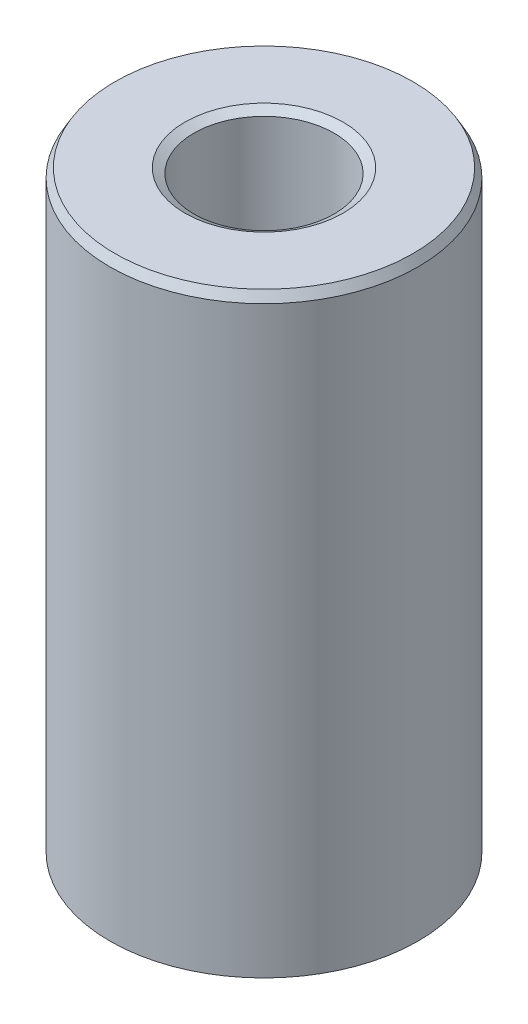
ISO-10303-21;
HEADER;
FILE_DESCRIPTION(('STEP AP214'),'2;1');
FILE_NAME('part.step','',(''),(''),'','','');
FILE_SCHEMA(('AUTOMOTIVE_DESIGN { 1 0 10303 214 1 1 1 1 }'));
ENDSEC;
DATA;
#1=APPLICATION_CONTEXT('core data for automotive mechanical design processes');
#2=APPLICATION_PROTOCOL_DEFINITION('international standard','automotive_design',2000,#1);
#3=PRODUCT_CONTEXT('',#1,'mechanical');
#4=PRODUCT('Part','Part','',(#3));
#5=PRODUCT_RELATED_PRODUCT_CATEGORY('part','',(#4));
#6=PRODUCT_DEFINITION_FORMATION('','',#4);
#7=PRODUCT_DEFINITION_CONTEXT('part definition',#1,'design');
#8=PRODUCT_DEFINITION('design','',#6,#7);
#9=PRODUCT_DEFINITION_SHAPE('','',#8);
#10=(LENGTH_UNIT() NAMED_UNIT(*) SI_UNIT(.MILLI.,.METRE.));
#11=(NAMED_UNIT(*) PLANE_ANGLE_UNIT() SI_UNIT($,.RADIAN.));
#12=(NAMED_UNIT(*) SI_UNIT($,.STERADIAN.) SOLID_ANGLE_UNIT());
#13=UNCERTAINTY_MEASURE_WITH_UNIT(LENGTH_MEASURE(1.E-05),#10,'distance_accuracy_value','');
#14=(GEOMETRIC_REPRESENTATION_CONTEXT(3) GLOBAL_UNCERTAINTY_ASSIGNED_CONTEXT((#13)) GLOBAL_UNIT_ASSIGNED_CONTEXT((#10,
#11,#12)) REPRESENTATION_CONTEXT('',''));
#15=CARTESIAN_POINT('',(0.,0.,0.));
#16=DIRECTION('',(0.,0.,1.));
#17=DIRECTION('',(1.,0.,0.));
#18=AXIS2_PLACEMENT_3D('',#15,#16,#17);
#19=CARTESIAN_POINT('',(0.,232.813612719743,0.));
#20=DIRECTION('',(0.,-1.,0.));
#21=DIRECTION('',(0.,0.,-1.));
#22=AXIS2_PLACEMENT_3D('',#19,#20,#21);
#23=CYLINDRICAL_SURFACE('',#22,60.);
#24=CARTESIAN_POINT('',(0.,2.00038068388453,0.));
#25=DIRECTION('',(0.,1.,0.));
#26=DIRECTION('',(0.,0.,1.));
#27=AXIS2_PLACEMENT_3D('',#24,#25,#26);
#28=CIRCLE('',#27,60.);
#29=CARTESIAN_POINT('',(0.,2.00038068388453,60.));
#30=VERTEX_POINT('',#29);
#31=EDGE_CURVE('E10',#30,#30,#28,.T.);
#32=ORIENTED_EDGE('',*,*,#31,.T.);
#33=EDGE_LOOP('',(#32));
#34=FACE_BOUND('',#33,.T.);
#35=CARTESIAN_POINT('',(0.,229.348851740776,0.));
#36=DIRECTION('',(0.,1.,0.));
#37=DIRECTION('',(0.,0.,1.));
#38=AXIS2_PLACEMENT_3D('',#35,#36,#37);
#39=CIRCLE('',#38,60.);
#40=CARTESIAN_POINT('',(0.,229.348851740776,-60.));
#41=VERTEX_POINT('',#40);
#42=EDGE_CURVE('E50',#41,#41,#39,.F.);
#43=ORIENTED_EDGE('',*,*,#42,.T.);
#44=EDGE_LOOP('',(#43));
#45=FACE_BOUND('',#44,.T.);
#46=ADVANCED_FACE('F39',(#34,#45),#23,.T.);
#47=CARTESIAN_POINT('',(0.,232.813612719743,0.));
#48=DIRECTION('',(0.,1.,0.));
#49=DIRECTION('',(0.,0.,1.));
#50=AXIS2_PLACEMENT_3D('',#47,#48,#49);
#51=PLANE('',#50);
#52=CARTESIAN_POINT('',(0.,232.813612719743,0.));
#53=DIRECTION('',(0.,1.,0.));
#54=DIRECTION('',(0.,0.,1.));
#55=AXIS2_PLACEMENT_3D('',#52,#53,#54);
#56=CIRCLE('',#55,30.7656044262218);
#57=CARTESIAN_POINT('',(0.,232.813612719743,30.7656044262218));
#58=VERTEX_POINT('',#57);
#59=EDGE_CURVE('E58',#58,#58,#56,.F.);
#60=ORIENTED_EDGE('',*,*,#59,.T.);
#61=EDGE_LOOP('',(#60));
#62=FACE_BOUND('',#61,.T.);
#63=CARTESIAN_POINT('',(0.,232.813612719743,0.));
#64=DIRECTION('',(0.,1.,0.));
#65=DIRECTION('',(0.,0.,1.));
#66=AXIS2_PLACEMENT_3D('',#63,#64,#65);
#67=CIRCLE('',#66,57.9996193161155);
#68=CARTESIAN_POINT('',(0.,232.813612719743,-57.9996193161155));
#69=VERTEX_POINT('',#68);
#70=EDGE_CURVE('E61',#69,#69,#67,.T.);
#71=ORIENTED_EDGE('',*,*,#70,.T.);
#72=EDGE_LOOP('',(#71));
#73=FACE_BOUND('',#72,.T.);
#74=ADVANCED_FACE('F88',(#62,#73),#51,.T.);
#75=CARTESIAN_POINT('',(0.,0.,0.));
#76=DIRECTION('',(0.,1.,0.));
#77=DIRECTION('',(0.,0.,1.));
#78=AXIS2_PLACEMENT_3D('',#75,#76,#77);
#79=PLANE('',#78);
#80=CARTESIAN_POINT('',(0.,0.,0.));
#81=DIRECTION('',(0.,1.,0.));
#82=DIRECTION('',(0.,0.,1.));
#83=AXIS2_PLACEMENT_3D('',#80,#81,#82);
#84=CIRCLE('',#83,29.301224131139);
#85=CARTESIAN_POINT('',(0.,0.,29.301224131139));
#86=VERTEX_POINT('',#85);
#87=EDGE_CURVE('E51',#86,#86,#84,.T.);
#88=ORIENTED_EDGE('',*,*,#87,.T.);
#89=EDGE_LOOP('',(#88));
#90=FACE_BOUND('',#89,.T.);
#91=CARTESIAN_POINT('',(0.,0.,0.));
#92=DIRECTION('',(0.,1.,0.));
#93=DIRECTION('',(0.,0.,1.));
#94=AXIS2_PLACEMENT_3D('',#91,#92,#93);
#95=CIRCLE('',#94,56.5352390210326);
#96=CARTESIAN_POINT('',(0.,0.,56.5352390210326));
#97=VERTEX_POINT('',#96);
#98=EDGE_CURVE('E54',#97,#97,#95,.F.);
#99=ORIENTED_EDGE('',*,*,#98,.T.);
#100=EDGE_LOOP('',(#99));
#101=FACE_BOUND('',#100,.T.);
#102=ADVANCED_FACE('F83',(#90,#101),#79,.F.);
#103=CARTESIAN_POINT('',(0.,232.813612719743,0.));
#104=DIRECTION('',(0.,-1.,0.));
#105=DIRECTION('',(0.,0.,-1.));
#106=AXIS2_PLACEMENT_3D('',#103,#104,#105);
#107=CYLINDRICAL_SURFACE('',#106,27.3008434472545);
#108=CARTESIAN_POINT('',(0.,230.813232035859,0.));
#109=DIRECTION('',(0.,1.,0.));
#110=DIRECTION('',(0.,0.,1.));
#111=AXIS2_PLACEMENT_3D('',#108,#109,#110);
#112=CIRCLE('',#111,27.3008434472545);
#113=CARTESIAN_POINT('',(0.,230.813232035859,27.3008434472545));
#114=VERTEX_POINT('',#113);
#115=EDGE_CURVE('E67',#114,#114,#112,.T.);
#116=ORIENTED_EDGE('',*,*,#115,.T.);
#117=EDGE_LOOP('',(#116));
#118=FACE_BOUND('',#117,.T.);
#119=CARTESIAN_POINT('',(0.,3.46476097896742,0.));
#120=DIRECTION('',(0.,1.,0.));
#121=DIRECTION('',(0.,0.,1.));
#122=AXIS2_PLACEMENT_3D('',#119,#120,#121);
#123=CIRCLE('',#122,27.3008434472545);
#124=CARTESIAN_POINT('',(0.,3.46476097896742,27.3008434472545));
#125=VERTEX_POINT('',#124);
#126=EDGE_CURVE('E69',#125,#125,#123,.F.);
#127=ORIENTED_EDGE('',*,*,#126,.T.);
#128=EDGE_LOOP('',(#127));
#129=FACE_BOUND('',#128,.T.);
#130=ADVANCED_FACE('F71',(#118,#129),#107,.F.);
#131=CARTESIAN_POINT('',(0.,230.813232035859,0.));
#132=DIRECTION('',(0.,1.,0.));
#133=DIRECTION('',(0.,0.,1.));
#134=AXIS2_PLACEMENT_3D('',#131,#132,#133);
#135=CONICAL_SURFACE('',#134,27.3008434472545,1.0471975511966);
#136=ORIENTED_EDGE('',*,*,#59,.F.);
#137=EDGE_LOOP('',(#136));
#138=FACE_BOUND('',#137,.T.);
#139=ORIENTED_EDGE('',*,*,#115,.F.);
#140=EDGE_LOOP('',(#139));
#141=FACE_BOUND('',#140,.T.);
#142=ADVANCED_FACE('F77',(#138,#141),#135,.F.);
#143=CARTESIAN_POINT('',(0.,0.,0.));
#144=DIRECTION('',(0.,-1.,0.));
#145=DIRECTION('',(0.,0.,-1.));
#146=AXIS2_PLACEMENT_3D('',#143,#144,#145);
#147=CONICAL_SURFACE('',#146,29.301224131139,0.5235987755983);
#148=ORIENTED_EDGE('',*,*,#126,.F.);
#149=EDGE_LOOP('',(#148));
#150=FACE_BOUND('',#149,.T.);
#151=ORIENTED_EDGE('',*,*,#87,.F.);
#152=EDGE_LOOP('',(#151));
#153=FACE_BOUND('',#152,.T.);
#154=ADVANCED_FACE('F73',(#150,#153),#147,.F.);
#155=CARTESIAN_POINT('',(0.,2.00038068388453,0.));
#156=DIRECTION('',(0.,1.,0.));
#157=DIRECTION('',(0.,0.,1.));
#158=AXIS2_PLACEMENT_3D('',#155,#156,#157);
#159=CONICAL_SURFACE('',#158,60.,1.0471975511966);
#160=ORIENTED_EDGE('',*,*,#98,.F.);
#161=EDGE_LOOP('',(#160));
#162=FACE_BOUND('',#161,.T.);
#163=ORIENTED_EDGE('',*,*,#31,.F.);
#164=EDGE_LOOP('',(#163));
#165=FACE_BOUND('',#164,.T.);
#166=ADVANCED_FACE('F76',(#162,#165),#159,.T.);
#167=CARTESIAN_POINT('',(0.,232.813612719743,0.));
#168=DIRECTION('',(0.,-1.,0.));
#169=DIRECTION('',(0.,0.,-1.));
#170=AXIS2_PLACEMENT_3D('',#167,#168,#169);
#171=CONICAL_SURFACE('',#170,57.9996193161155,0.523598775598292);
#172=CARTESIAN_POINT('',(0.,229.348851740776,-60.));
#173=CARTESIAN_POINT('',(0.,229.384943000973,-59.9791627012095));
#174=CARTESIAN_POINT('',(0.,229.421034261171,-59.9583254024191));
#175=CARTESIAN_POINT('',(0.,229.493216781566,-59.9166508048381));
#176=CARTESIAN_POINT('',(0.,229.529308041764,-59.8958135060477));
#177=CARTESIAN_POINT('',(0.,229.601490562159,-59.8541389084668));
#178=CARTESIAN_POINT('',(0.,229.637581822357,-59.8333016096763));
#179=CARTESIAN_POINT('',(0.,229.709764342752,-59.7916270120954));
#180=CARTESIAN_POINT('',(0.,229.745855602949,-59.7707897133049));
#181=CARTESIAN_POINT('',(0.,229.818038123344,-59.729115115724));
#182=CARTESIAN_POINT('',(0.,229.854129383542,-59.7082778169335));
#183=CARTESIAN_POINT('',(0.,229.926311903937,-59.6666032193526));
#184=CARTESIAN_POINT('',(0.,229.962403164135,-59.6457659205621));
#185=CARTESIAN_POINT('',(0.,230.03458568453,-59.6040913229812));
#186=CARTESIAN_POINT('',(0.,230.070676944727,-59.5832540241907));
#187=CARTESIAN_POINT('',(0.,230.142859465123,-59.5415794266098));
#188=CARTESIAN_POINT('',(0.,230.17895072532,-59.5207421278193));
#189=CARTESIAN_POINT('',(0.,230.251133245715,-59.4790675302384));
#190=CARTESIAN_POINT('',(0.,230.287224505913,-59.458230231448));
#191=CARTESIAN_POINT('',(0.,230.359407026308,-59.416555633867));
#192=CARTESIAN_POINT('',(0.,230.395498286506,-59.3957183350766));
#193=CARTESIAN_POINT('',(0.,230.467680806901,-59.3540437374956));
#194=CARTESIAN_POINT('',(0.,230.503772067098,-59.3332064387052));
#195=CARTESIAN_POINT('',(0.,230.575954587494,-59.2915318411242));
#196=CARTESIAN_POINT('',(0.,230.612045847691,-59.2706945423338));
#197=CARTESIAN_POINT('',(0.,230.684228368086,-59.2290199447529));
#198=CARTESIAN_POINT('',(0.,230.720319628284,-59.2081826459624));
#199=CARTESIAN_POINT('',(0.,230.792502148679,-59.1665080483815));
#200=CARTESIAN_POINT('',(0.,230.828593408877,-59.145670749591));
#201=CARTESIAN_POINT('',(0.,230.900775929272,-59.1039961520101));
#202=CARTESIAN_POINT('',(0.,230.936867189469,-59.0831588532196));
#203=CARTESIAN_POINT('',(0.,231.009049709864,-59.0414842556387));
#204=CARTESIAN_POINT('',(0.,231.045140970062,-59.0206469568482));
#205=CARTESIAN_POINT('',(0.,231.117323490457,-58.9789723592673));
#206=CARTESIAN_POINT('',(0.,231.153414750655,-58.9581350604768));
#207=CARTESIAN_POINT('',(0.,231.22559727105,-58.9164604628959));
#208=CARTESIAN_POINT('',(0.,231.261688531248,-58.8956231641054));
#209=CARTESIAN_POINT('',(0.,231.333871051643,-58.8539485665245));
#210=CARTESIAN_POINT('',(0.,231.36996231184,-58.833111267734));
#211=CARTESIAN_POINT('',(0.,231.442144832235,-58.7914366701531));
#212=CARTESIAN_POINT('',(0.,231.478236092433,-58.7705993713627));
#213=CARTESIAN_POINT('',(0.,231.550418612828,-58.7289247737817));
#214=CARTESIAN_POINT('',(0.,231.586509873026,-58.7080874749913));
#215=CARTESIAN_POINT('',(0.,231.658692393421,-58.6664128774103));
#216=CARTESIAN_POINT('',(0.,231.694783653618,-58.6455755786199));
#217=CARTESIAN_POINT('',(0.,231.766966174014,-58.603900981039));
#218=CARTESIAN_POINT('',(0.,231.803057434211,-58.5830636822485));
#219=CARTESIAN_POINT('',(0.,231.875239954606,-58.5413890846676));
#220=CARTESIAN_POINT('',(0.,231.911331214804,-58.5205517858771));
#221=CARTESIAN_POINT('',(0.,231.983513735199,-58.4788771882962));
#222=CARTESIAN_POINT('',(0.,232.019604995397,-58.4580398895057));
#223=CARTESIAN_POINT('',(0.,232.091787515792,-58.4163652919248));
#224=CARTESIAN_POINT('',(0.,232.127878775989,-58.3955279931343));
#225=CARTESIAN_POINT('',(0.,232.200061296384,-58.3538533955534));
#226=CARTESIAN_POINT('',(0.,232.236152556582,-58.3330160967629));
#227=CARTESIAN_POINT('',(0.,232.308335076977,-58.291341499182));
#228=CARTESIAN_POINT('',(0.,232.344426337175,-58.2705042003915));
#229=CARTESIAN_POINT('',(0.,232.41660885757,-58.2288296028106));
#230=CARTESIAN_POINT('',(0.,232.452700117768,-58.2079923040201));
#231=CARTESIAN_POINT('',(0.,232.524882638163,-58.1663177064392));
#232=CARTESIAN_POINT('',(0.,232.56097389836,-58.1454804076488));
#233=CARTESIAN_POINT('',(0.,232.633156418755,-58.1038058100678));
#234=CARTESIAN_POINT('',(0.,232.669247678953,-58.0829685112774));
#235=CARTESIAN_POINT('',(0.,232.741430199348,-58.0412939136964));
#236=CARTESIAN_POINT('',(0.,232.777521459546,-58.020456614906));
#237=CARTESIAN_POINT('',(0.,232.813612719743,-57.9996193161155));
#238=B_SPLINE_CURVE_WITH_KNOTS('',3,(#172,#173,#174,#175,#176,#177,#178,#179,#180,#181,#182,
#183,#184,#185,#186,#187,#188,#189,#190,#191,#192,#193,#194,#195,#196,#197,#198,#199,#200,#201,
#202,#203,#204,#205,#206,#207,#208,#209,#210,#211,#212,#213,#214,#215,#216,#217,#218,#219,#220,
#221,#222,#223,#224,#225,#226,#227,#228,#229,#230,#231,#232,#233,#234,#235,#236,#237),
.UNSPECIFIED.,.F.,.F.,(4,2,2,2,2,2,2,2,2,2,2,2,2,2,2,2,2,2,2,2,2,2,2,2,2,2,2,2,2,2,2,2,4),(0.,
0.125023792742773,0.25004758548555,0.375071378228347,0.500095170971121,0.625118963713898,
0.750142756456695,0.875166549199468,1.00019034194224,1.12521413468504,1.25023792742782,
1.37526172017059,1.50028551291339,1.62530930565617,1.75033309839894,1.87535689114174,
2.00038068388451,2.12540447662729,2.25042826937009,2.37545206211286,2.50047585485563,
2.62549964759844,2.75052344034121,2.87554723308398,3.00057102582678,3.12559481856956,
3.25061861131233,3.37564240405513,3.5006661967979,3.62568998954068,3.75071378228348,
3.87573757502625,4.00076136776905),.UNSPECIFIED.);
#239=EDGE_CURVE('BSEAM45',#41,#69,#238,.T.);
#240=ORIENTED_EDGE('',*,*,#42,.F.);
#241=ORIENTED_EDGE('',*,*,#70,.F.);
#242=ORIENTED_EDGE('',*,*,#239,.T.);
#243=ORIENTED_EDGE('',*,*,#239,.F.);
#244=EDGE_LOOP('',(#240,#242,#241,#243));
#245=FACE_BOUND('',#244,.T.);
#246=ADVANCED_FACE('F45',(#245),#171,.T.);
#247=CLOSED_SHELL('',(#46,#74,#102,#130,#142,#154,#166,#246));
#248=MANIFOLD_SOLID_BREP('B2',#247);
#249=ADVANCED_BREP_SHAPE_REPRESENTATION('',(#18,#248),#14);
#250=SHAPE_DEFINITION_REPRESENTATION(#9,#249);
ENDSEC;
END-ISO-10303-21;
